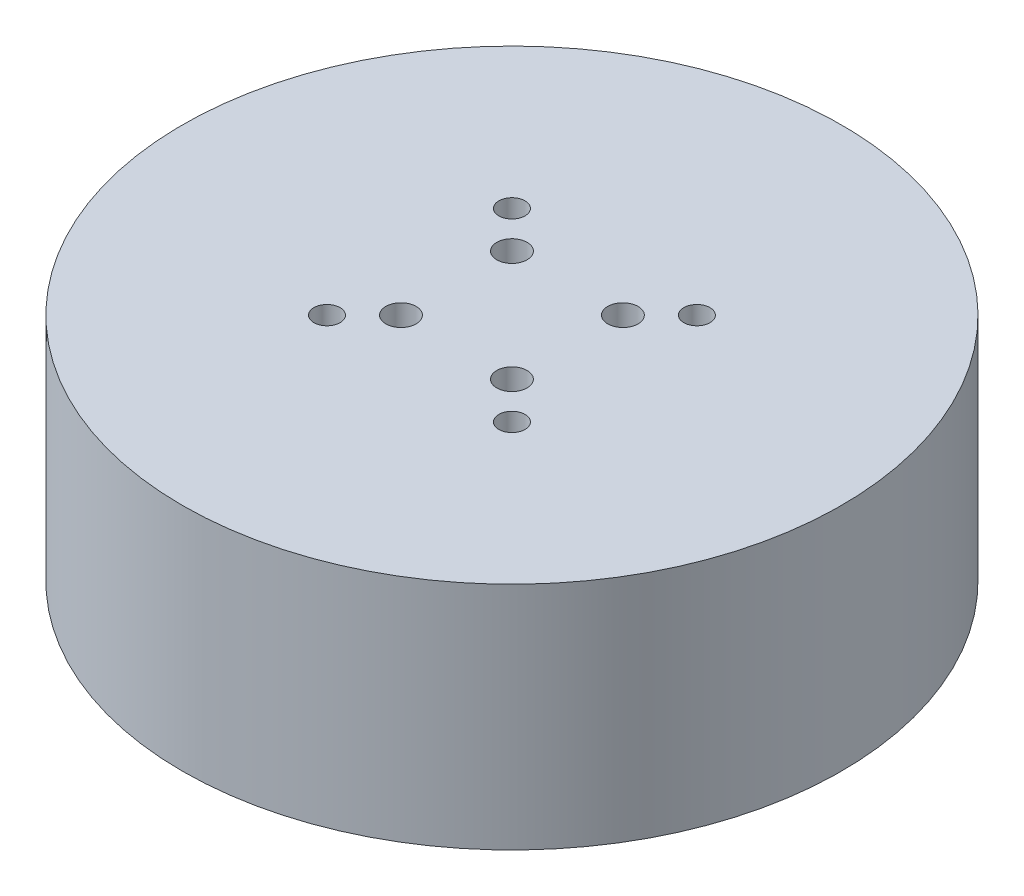
ISO-10303-21;
HEADER;
FILE_DESCRIPTION(('STEP AP214'),'2;1');
FILE_NAME('part.step','',(''),(''),'','','');
FILE_SCHEMA(('AUTOMOTIVE_DESIGN { 1 0 10303 214 1 1 1 1 }'));
ENDSEC;
DATA;
#1=APPLICATION_CONTEXT('core data for automotive mechanical design processes');
#2=APPLICATION_PROTOCOL_DEFINITION('international standard','automotive_design',2000,#1);
#3=PRODUCT_CONTEXT('',#1,'mechanical');
#4=PRODUCT('Part','Part','',(#3));
#5=PRODUCT_RELATED_PRODUCT_CATEGORY('part','',(#4));
#6=PRODUCT_DEFINITION_FORMATION('','',#4);
#7=PRODUCT_DEFINITION_CONTEXT('part definition',#1,'design');
#8=PRODUCT_DEFINITION('design','',#6,#7);
#9=PRODUCT_DEFINITION_SHAPE('','',#8);
#10=(LENGTH_UNIT() NAMED_UNIT(*) SI_UNIT(.MILLI.,.METRE.));
#11=(NAMED_UNIT(*) PLANE_ANGLE_UNIT() SI_UNIT($,.RADIAN.));
#12=(NAMED_UNIT(*) SI_UNIT($,.STERADIAN.) SOLID_ANGLE_UNIT());
#13=UNCERTAINTY_MEASURE_WITH_UNIT(LENGTH_MEASURE(1.E-05),#10,'distance_accuracy_value','');
#14=(GEOMETRIC_REPRESENTATION_CONTEXT(3) GLOBAL_UNCERTAINTY_ASSIGNED_CONTEXT((#13)) GLOBAL_UNIT_ASSIGNED_CONTEXT((#10,
#11,#12)) REPRESENTATION_CONTEXT('',''));
#15=CARTESIAN_POINT('',(0.,0.,0.));
#16=DIRECTION('',(0.,0.,1.));
#17=DIRECTION('',(1.,0.,0.));
#18=AXIS2_PLACEMENT_3D('',#15,#16,#17);
#19=CARTESIAN_POINT('',(0.,22.,0.));
#20=DIRECTION('',(0.,-1.,0.));
#21=DIRECTION('',(0.,0.,-1.));
#22=AXIS2_PLACEMENT_3D('',#19,#20,#21);
#23=CYLINDRICAL_SURFACE('',#22,31.5);
#24=CARTESIAN_POINT('',(0.,22.,0.));
#25=DIRECTION('',(0.,1.,0.));
#26=DIRECTION('',(0.,0.,1.));
#27=AXIS2_PLACEMENT_3D('',#24,#25,#26);
#28=CIRCLE('',#27,31.5);
#29=CARTESIAN_POINT('',(0.,22.,31.5));
#30=VERTEX_POINT('',#29);
#31=EDGE_CURVE('E11',#30,#30,#28,.T.);
#32=ORIENTED_EDGE('',*,*,#31,.F.);
#33=EDGE_LOOP('',(#32));
#34=FACE_BOUND('',#33,.T.);
#35=CARTESIAN_POINT('',(0.,0.,0.));
#36=DIRECTION('',(0.,1.,0.));
#37=DIRECTION('',(0.,0.,1.));
#38=AXIS2_PLACEMENT_3D('',#35,#36,#37);
#39=CIRCLE('',#38,31.5);
#40=CARTESIAN_POINT('',(0.,0.,31.5));
#41=VERTEX_POINT('',#40);
#42=EDGE_CURVE('E40',#41,#41,#39,.T.);
#43=ORIENTED_EDGE('',*,*,#42,.T.);
#44=EDGE_LOOP('',(#43));
#45=FACE_BOUND('',#44,.T.);
#46=ADVANCED_FACE('F37',(#34,#45),#23,.T.);
#47=CARTESIAN_POINT('',(0.,22.,0.));
#48=DIRECTION('',(0.,1.,0.));
#49=DIRECTION('',(0.,0.,1.));
#50=AXIS2_PLACEMENT_3D('',#47,#48,#49);
#51=PLANE('',#50);
#52=CARTESIAN_POINT('',(5.3033008588991,22.,-5.30330085889911));
#53=DIRECTION('',(0.,1.,0.));
#54=DIRECTION('',(0.,0.,1.));
#55=AXIS2_PLACEMENT_3D('',#52,#53,#54);
#56=CIRCLE('',#55,1.45);
#57=CARTESIAN_POINT('',(5.3033008588991,22.,-3.85330085889911));
#58=VERTEX_POINT('',#57);
#59=EDGE_CURVE('E245',#58,#58,#56,.T.);
#60=ORIENTED_EDGE('',*,*,#59,.F.);
#61=EDGE_LOOP('',(#60));
#62=FACE_BOUND('',#61,.T.);
#63=CARTESIAN_POINT('',(5.30330085889911,22.,5.30330085889911));
#64=DIRECTION('',(0.,1.,0.));
#65=DIRECTION('',(0.,0.,1.));
#66=AXIS2_PLACEMENT_3D('',#63,#64,#65);
#67=CIRCLE('',#66,1.45);
#68=CARTESIAN_POINT('',(5.30330085889911,22.,6.75330085889911));
#69=VERTEX_POINT('',#68);
#70=EDGE_CURVE('E247',#69,#69,#67,.T.);
#71=ORIENTED_EDGE('',*,*,#70,.F.);
#72=EDGE_LOOP('',(#71));
#73=FACE_BOUND('',#72,.T.);
#74=CARTESIAN_POINT('',(-5.30330085889911,22.,5.30330085889911));
#75=DIRECTION('',(0.,1.,0.));
#76=DIRECTION('',(0.,0.,1.));
#77=AXIS2_PLACEMENT_3D('',#74,#75,#76);
#78=CIRCLE('',#77,1.45);
#79=CARTESIAN_POINT('',(-5.30330085889911,22.,6.75330085889911));
#80=VERTEX_POINT('',#79);
#81=EDGE_CURVE('E255',#80,#80,#78,.T.);
#82=ORIENTED_EDGE('',*,*,#81,.F.);
#83=EDGE_LOOP('',(#82));
#84=FACE_BOUND('',#83,.T.);
#85=CARTESIAN_POINT('',(-5.30330085889911,22.,-5.3033008588991));
#86=DIRECTION('',(0.,1.,0.));
#87=DIRECTION('',(0.,0.,1.));
#88=AXIS2_PLACEMENT_3D('',#85,#86,#87);
#89=CIRCLE('',#88,1.45);
#90=CARTESIAN_POINT('',(-5.30330085889911,22.,-3.85330085889911));
#91=VERTEX_POINT('',#90);
#92=EDGE_CURVE('E261',#91,#91,#89,.T.);
#93=ORIENTED_EDGE('',*,*,#92,.F.);
#94=EDGE_LOOP('',(#93));
#95=FACE_BOUND('',#94,.T.);
#96=CARTESIAN_POINT('',(8.83883476483184,22.,-8.83883476483184));
#97=DIRECTION('',(0.,1.,0.));
#98=DIRECTION('',(0.,0.,1.));
#99=AXIS2_PLACEMENT_3D('',#96,#97,#98);
#100=CIRCLE('',#99,1.24999999999999);
#101=CARTESIAN_POINT('',(8.83883476483184,22.,-7.58883476483186));
#102=VERTEX_POINT('',#101);
#103=EDGE_CURVE('E68',#102,#102,#100,.T.);
#104=ORIENTED_EDGE('',*,*,#103,.F.);
#105=EDGE_LOOP('',(#104));
#106=FACE_BOUND('',#105,.T.);
#107=CARTESIAN_POINT('',(8.83883476483185,22.,8.83883476483184));
#108=DIRECTION('',(0.,1.,0.));
#109=DIRECTION('',(0.,0.,1.));
#110=AXIS2_PLACEMENT_3D('',#107,#108,#109);
#111=CIRCLE('',#110,1.24999999999999);
#112=CARTESIAN_POINT('',(8.83883476483185,22.,10.0888347648318));
#113=VERTEX_POINT('',#112);
#114=EDGE_CURVE('E67',#113,#113,#111,.T.);
#115=ORIENTED_EDGE('',*,*,#114,.F.);
#116=EDGE_LOOP('',(#115));
#117=FACE_BOUND('',#116,.T.);
#118=CARTESIAN_POINT('',(-8.83883476483184,22.,8.83883476483184));
#119=DIRECTION('',(0.,1.,0.));
#120=DIRECTION('',(0.,0.,1.));
#121=AXIS2_PLACEMENT_3D('',#118,#119,#120);
#122=CIRCLE('',#121,1.24999999999999);
#123=CARTESIAN_POINT('',(-8.83883476483184,22.,10.0888347648318));
#124=VERTEX_POINT('',#123);
#125=EDGE_CURVE('E80',#124,#124,#122,.T.);
#126=ORIENTED_EDGE('',*,*,#125,.F.);
#127=EDGE_LOOP('',(#126));
#128=FACE_BOUND('',#127,.T.);
#129=CARTESIAN_POINT('',(-8.83883476483184,22.,-8.83883476483184));
#130=DIRECTION('',(0.,1.,0.));
#131=DIRECTION('',(0.,0.,1.));
#132=AXIS2_PLACEMENT_3D('',#129,#130,#131);
#133=CIRCLE('',#132,1.24999999999999);
#134=CARTESIAN_POINT('',(-8.83883476483184,22.,-7.58883476483186));
#135=VERTEX_POINT('',#134);
#136=EDGE_CURVE('E86',#135,#135,#133,.T.);
#137=ORIENTED_EDGE('',*,*,#136,.F.);
#138=EDGE_LOOP('',(#137));
#139=FACE_BOUND('',#138,.T.);
#140=ORIENTED_EDGE('',*,*,#31,.T.);
#141=EDGE_LOOP('',(#140));
#142=FACE_BOUND('',#141,.T.);
#143=ADVANCED_FACE('F100',(#62,#73,#84,#95,#106,#117,#128,#139,#142),#51,.T.);
#144=CARTESIAN_POINT('',(0.,0.,0.));
#145=DIRECTION('',(0.,1.,0.));
#146=DIRECTION('',(0.,0.,1.));
#147=AXIS2_PLACEMENT_3D('',#144,#145,#146);
#148=PLANE('',#147);
#149=CARTESIAN_POINT('',(5.3033008588991,0.,-5.30330085889911));
#150=DIRECTION('',(0.,1.,0.));
#151=DIRECTION('',(0.,0.,1.));
#152=AXIS2_PLACEMENT_3D('',#149,#150,#151);
#153=CIRCLE('',#152,1.45);
#154=CARTESIAN_POINT('',(5.3033008588991,0.,-3.85330085889911));
#155=VERTEX_POINT('',#154);
#156=EDGE_CURVE('E242',#155,#155,#153,.T.);
#157=ORIENTED_EDGE('',*,*,#156,.T.);
#158=EDGE_LOOP('',(#157));
#159=FACE_BOUND('',#158,.T.);
#160=CARTESIAN_POINT('',(5.30330085889911,0.,5.30330085889911));
#161=DIRECTION('',(0.,1.,0.));
#162=DIRECTION('',(0.,0.,1.));
#163=AXIS2_PLACEMENT_3D('',#160,#161,#162);
#164=CIRCLE('',#163,1.45);
#165=CARTESIAN_POINT('',(5.30330085889911,0.,6.7533008588991));
#166=VERTEX_POINT('',#165);
#167=EDGE_CURVE('E252',#166,#166,#164,.T.);
#168=ORIENTED_EDGE('',*,*,#167,.T.);
#169=EDGE_LOOP('',(#168));
#170=FACE_BOUND('',#169,.T.);
#171=CARTESIAN_POINT('',(-5.30330085889911,0.,5.30330085889911));
#172=DIRECTION('',(0.,1.,0.));
#173=DIRECTION('',(0.,0.,1.));
#174=AXIS2_PLACEMENT_3D('',#171,#172,#173);
#175=CIRCLE('',#174,1.45);
#176=CARTESIAN_POINT('',(-5.30330085889911,0.,6.7533008588991));
#177=VERTEX_POINT('',#176);
#178=EDGE_CURVE('E258',#177,#177,#175,.T.);
#179=ORIENTED_EDGE('',*,*,#178,.T.);
#180=EDGE_LOOP('',(#179));
#181=FACE_BOUND('',#180,.T.);
#182=CARTESIAN_POINT('',(-5.30330085889911,0.,-5.3033008588991));
#183=DIRECTION('',(0.,1.,0.));
#184=DIRECTION('',(0.,0.,1.));
#185=AXIS2_PLACEMENT_3D('',#182,#183,#184);
#186=CIRCLE('',#185,1.45);
#187=CARTESIAN_POINT('',(-5.30330085889911,0.,-3.85330085889911));
#188=VERTEX_POINT('',#187);
#189=EDGE_CURVE('E74',#188,#188,#186,.T.);
#190=ORIENTED_EDGE('',*,*,#189,.T.);
#191=EDGE_LOOP('',(#190));
#192=FACE_BOUND('',#191,.T.);
#193=ORIENTED_EDGE('',*,*,#42,.F.);
#194=EDGE_LOOP('',(#193));
#195=FACE_BOUND('',#194,.T.);
#196=ADVANCED_FACE('F97',(#159,#170,#181,#192,#195),#148,.F.);
#197=CARTESIAN_POINT('',(-8.83883476483184,17.24,-8.83883476483184));
#198=DIRECTION('',(0.,1.,0.));
#199=DIRECTION('',(0.,0.,1.));
#200=AXIS2_PLACEMENT_3D('',#197,#198,#199);
#201=CONICAL_SURFACE('',#200,1.24999999999999,1.02974425867665);
#202=CARTESIAN_POINT('',(-8.83883476483185,16.4889242262156,-8.83883476483184));
#203=VERTEX_POINT('',#202);
#204=VERTEX_LOOP('',#203);
#205=FACE_BOUND('',#204,.T.);
#206=CARTESIAN_POINT('',(-8.83883476483184,17.24,-8.83883476483184));
#207=DIRECTION('',(0.,1.,0.));
#208=DIRECTION('',(0.,0.,1.));
#209=AXIS2_PLACEMENT_3D('',#206,#207,#208);
#210=CIRCLE('',#209,1.24999999999999);
#211=CARTESIAN_POINT('',(-8.83883476483184,17.24,-7.58883476483186));
#212=VERTEX_POINT('',#211);
#213=EDGE_CURVE('E89',#212,#212,#210,.T.);
#214=ORIENTED_EDGE('',*,*,#213,.T.);
#215=EDGE_LOOP('',(#214));
#216=FACE_BOUND('',#215,.T.);
#217=ADVANCED_FACE('F99',(#205,#216),#201,.F.);
#218=CARTESIAN_POINT('',(-8.83883476483184,22.,-8.83883476483184));
#219=DIRECTION('',(0.,1.,0.));
#220=DIRECTION('',(0.,0.,1.));
#221=AXIS2_PLACEMENT_3D('',#218,#219,#220);
#222=CYLINDRICAL_SURFACE('',#221,1.24999999999999);
#223=ORIENTED_EDGE('',*,*,#213,.F.);
#224=EDGE_LOOP('',(#223));
#225=FACE_BOUND('',#224,.T.);
#226=ORIENTED_EDGE('',*,*,#136,.T.);
#227=EDGE_LOOP('',(#226));
#228=FACE_BOUND('',#227,.T.);
#229=ADVANCED_FACE('F106',(#225,#228),#222,.F.);
#230=CARTESIAN_POINT('',(-8.83883476483184,17.24,8.83883476483184));
#231=DIRECTION('',(0.,1.,0.));
#232=DIRECTION('',(0.,0.,1.));
#233=AXIS2_PLACEMENT_3D('',#230,#231,#232);
#234=CONICAL_SURFACE('',#233,1.24999999999999,1.02974425867665);
#235=CARTESIAN_POINT('',(-8.83883476483185,16.4889242262156,8.83883476483184));
#236=VERTEX_POINT('',#235);
#237=VERTEX_LOOP('',#236);
#238=FACE_BOUND('',#237,.T.);
#239=CARTESIAN_POINT('',(-8.83883476483184,17.24,8.83883476483184));
#240=DIRECTION('',(0.,1.,0.));
#241=DIRECTION('',(0.,0.,1.));
#242=AXIS2_PLACEMENT_3D('',#239,#240,#241);
#243=CIRCLE('',#242,1.24999999999999);
#244=CARTESIAN_POINT('',(-8.83883476483184,17.24,10.0888347648318));
#245=VERTEX_POINT('',#244);
#246=EDGE_CURVE('E83',#245,#245,#243,.T.);
#247=ORIENTED_EDGE('',*,*,#246,.T.);
#248=EDGE_LOOP('',(#247));
#249=FACE_BOUND('',#248,.T.);
#250=ADVANCED_FACE('F143',(#238,#249),#234,.F.);
#251=CARTESIAN_POINT('',(-8.83883476483184,22.,8.83883476483184));
#252=DIRECTION('',(0.,1.,0.));
#253=DIRECTION('',(0.,0.,1.));
#254=AXIS2_PLACEMENT_3D('',#251,#252,#253);
#255=CYLINDRICAL_SURFACE('',#254,1.24999999999999);
#256=ORIENTED_EDGE('',*,*,#246,.F.);
#257=EDGE_LOOP('',(#256));
#258=FACE_BOUND('',#257,.T.);
#259=ORIENTED_EDGE('',*,*,#125,.T.);
#260=EDGE_LOOP('',(#259));
#261=FACE_BOUND('',#260,.T.);
#262=ADVANCED_FACE('F151',(#258,#261),#255,.F.);
#263=CARTESIAN_POINT('',(8.83883476483185,17.24,8.83883476483184));
#264=DIRECTION('',(0.,1.,0.));
#265=DIRECTION('',(0.,0.,1.));
#266=AXIS2_PLACEMENT_3D('',#263,#264,#265);
#267=CONICAL_SURFACE('',#266,1.24999999999999,1.02974425867665);
#268=CARTESIAN_POINT('',(8.83883476483184,16.4889242262156,8.83883476483184));
#269=VERTEX_POINT('',#268);
#270=VERTEX_LOOP('',#269);
#271=FACE_BOUND('',#270,.T.);
#272=CARTESIAN_POINT('',(8.83883476483185,17.24,8.83883476483184));
#273=DIRECTION('',(0.,1.,0.));
#274=DIRECTION('',(0.,0.,1.));
#275=AXIS2_PLACEMENT_3D('',#272,#273,#274);
#276=CIRCLE('',#275,1.24999999999999);
#277=CARTESIAN_POINT('',(8.83883476483185,17.24,10.0888347648318));
#278=VERTEX_POINT('',#277);
#279=EDGE_CURVE('E71',#278,#278,#276,.T.);
#280=ORIENTED_EDGE('',*,*,#279,.T.);
#281=EDGE_LOOP('',(#280));
#282=FACE_BOUND('',#281,.T.);
#283=ADVANCED_FACE('F158',(#271,#282),#267,.F.);
#284=CARTESIAN_POINT('',(8.83883476483185,22.,8.83883476483184));
#285=DIRECTION('',(0.,1.,0.));
#286=DIRECTION('',(0.,0.,1.));
#287=AXIS2_PLACEMENT_3D('',#284,#285,#286);
#288=CYLINDRICAL_SURFACE('',#287,1.24999999999999);
#289=ORIENTED_EDGE('',*,*,#279,.F.);
#290=EDGE_LOOP('',(#289));
#291=FACE_BOUND('',#290,.T.);
#292=ORIENTED_EDGE('',*,*,#114,.T.);
#293=EDGE_LOOP('',(#292));
#294=FACE_BOUND('',#293,.T.);
#295=ADVANCED_FACE('F61',(#291,#294),#288,.F.);
#296=CARTESIAN_POINT('',(8.83883476483184,17.24,-8.83883476483184));
#297=DIRECTION('',(0.,1.,0.));
#298=DIRECTION('',(0.,0.,1.));
#299=AXIS2_PLACEMENT_3D('',#296,#297,#298);
#300=CONICAL_SURFACE('',#299,1.24999999999999,1.02974425867665);
#301=CARTESIAN_POINT('',(8.83883476483184,16.4889242262156,-8.83883476483184));
#302=VERTEX_POINT('',#301);
#303=VERTEX_LOOP('',#302);
#304=FACE_BOUND('',#303,.T.);
#305=CARTESIAN_POINT('',(8.83883476483184,17.24,-8.83883476483184));
#306=DIRECTION('',(0.,1.,0.));
#307=DIRECTION('',(0.,0.,1.));
#308=AXIS2_PLACEMENT_3D('',#305,#306,#307);
#309=CIRCLE('',#308,1.24999999999999);
#310=CARTESIAN_POINT('',(8.83883476483184,17.24,-7.58883476483186));
#311=VERTEX_POINT('',#310);
#312=EDGE_CURVE('E65',#311,#311,#309,.T.);
#313=ORIENTED_EDGE('',*,*,#312,.T.);
#314=EDGE_LOOP('',(#313));
#315=FACE_BOUND('',#314,.T.);
#316=ADVANCED_FACE('F57',(#304,#315),#300,.F.);
#317=CARTESIAN_POINT('',(8.83883476483184,22.,-8.83883476483184));
#318=DIRECTION('',(0.,1.,0.));
#319=DIRECTION('',(0.,0.,1.));
#320=AXIS2_PLACEMENT_3D('',#317,#318,#319);
#321=CYLINDRICAL_SURFACE('',#320,1.24999999999999);
#322=ORIENTED_EDGE('',*,*,#312,.F.);
#323=EDGE_LOOP('',(#322));
#324=FACE_BOUND('',#323,.T.);
#325=ORIENTED_EDGE('',*,*,#103,.T.);
#326=EDGE_LOOP('',(#325));
#327=FACE_BOUND('',#326,.T.);
#328=ADVANCED_FACE('F60',(#324,#327),#321,.F.);
#329=CARTESIAN_POINT('',(-5.30330085889911,22.,-5.3033008588991));
#330=DIRECTION('',(0.,1.,0.));
#331=DIRECTION('',(0.,0.,1.));
#332=AXIS2_PLACEMENT_3D('',#329,#330,#331);
#333=CYLINDRICAL_SURFACE('',#332,1.45);
#334=ORIENTED_EDGE('',*,*,#189,.F.);
#335=EDGE_LOOP('',(#334));
#336=FACE_BOUND('',#335,.T.);
#337=ORIENTED_EDGE('',*,*,#92,.T.);
#338=EDGE_LOOP('',(#337));
#339=FACE_BOUND('',#338,.T.);
#340=ADVANCED_FACE('F183',(#336,#339),#333,.F.);
#341=CARTESIAN_POINT('',(-5.30330085889911,22.,5.30330085889911));
#342=DIRECTION('',(0.,1.,0.));
#343=DIRECTION('',(0.,0.,1.));
#344=AXIS2_PLACEMENT_3D('',#341,#342,#343);
#345=CYLINDRICAL_SURFACE('',#344,1.45);
#346=ORIENTED_EDGE('',*,*,#178,.F.);
#347=EDGE_LOOP('',(#346));
#348=FACE_BOUND('',#347,.T.);
#349=ORIENTED_EDGE('',*,*,#81,.T.);
#350=EDGE_LOOP('',(#349));
#351=FACE_BOUND('',#350,.T.);
#352=ADVANCED_FACE('F189',(#348,#351),#345,.F.);
#353=CARTESIAN_POINT('',(5.30330085889911,22.,5.30330085889911));
#354=DIRECTION('',(0.,1.,0.));
#355=DIRECTION('',(0.,0.,1.));
#356=AXIS2_PLACEMENT_3D('',#353,#354,#355);
#357=CYLINDRICAL_SURFACE('',#356,1.45);
#358=ORIENTED_EDGE('',*,*,#167,.F.);
#359=EDGE_LOOP('',(#358));
#360=FACE_BOUND('',#359,.T.);
#361=ORIENTED_EDGE('',*,*,#70,.T.);
#362=EDGE_LOOP('',(#361));
#363=FACE_BOUND('',#362,.T.);
#364=ADVANCED_FACE('F197',(#360,#363),#357,.F.);
#365=CARTESIAN_POINT('',(5.3033008588991,22.,-5.30330085889911));
#366=DIRECTION('',(0.,1.,0.));
#367=DIRECTION('',(0.,0.,1.));
#368=AXIS2_PLACEMENT_3D('',#365,#366,#367);
#369=CYLINDRICAL_SURFACE('',#368,1.45);
#370=ORIENTED_EDGE('',*,*,#156,.F.);
#371=EDGE_LOOP('',(#370));
#372=FACE_BOUND('',#371,.T.);
#373=ORIENTED_EDGE('',*,*,#59,.T.);
#374=EDGE_LOOP('',(#373));
#375=FACE_BOUND('',#374,.T.);
#376=ADVANCED_FACE('F205',(#372,#375),#369,.F.);
#377=CLOSED_SHELL('',(#46,#143,#196,#217,#229,#250,#262,#283,#295,#316,#328,#340,#352,#364,#376));
#378=MANIFOLD_SOLID_BREP('B2',#377);
#379=ADVANCED_BREP_SHAPE_REPRESENTATION('',(#18,#378),#14);
#380=SHAPE_DEFINITION_REPRESENTATION(#9,#379);
ENDSEC;
END-ISO-10303-21;
